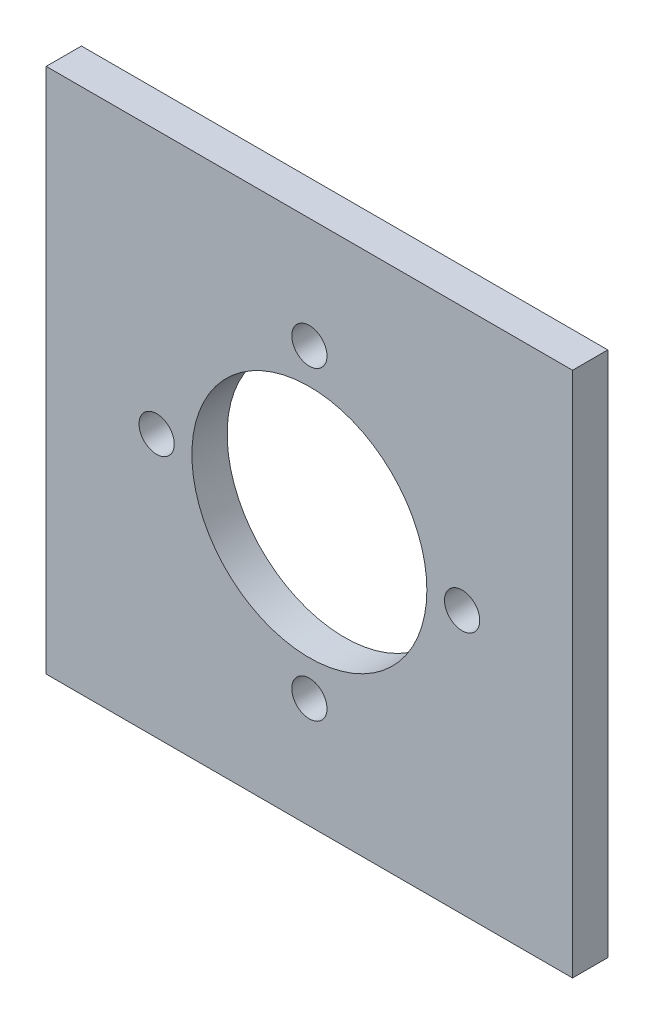
ISO-10303-21;
HEADER;
FILE_DESCRIPTION(('STEP AP214'),'2;1');
FILE_NAME('part.step','',(''),(''),'','','');
FILE_SCHEMA(('AUTOMOTIVE_DESIGN { 1 0 10303 214 1 1 1 1 }'));
ENDSEC;
DATA;
#1=APPLICATION_CONTEXT('core data for automotive mechanical design processes');
#2=APPLICATION_PROTOCOL_DEFINITION('international standard','automotive_design',2000,#1);
#3=PRODUCT_CONTEXT('',#1,'mechanical');
#4=PRODUCT('Part','Part','',(#3));
#5=PRODUCT_RELATED_PRODUCT_CATEGORY('part','',(#4));
#6=PRODUCT_DEFINITION_FORMATION('','',#4);
#7=PRODUCT_DEFINITION_CONTEXT('part definition',#1,'design');
#8=PRODUCT_DEFINITION('design','',#6,#7);
#9=PRODUCT_DEFINITION_SHAPE('','',#8);
#10=(LENGTH_UNIT() NAMED_UNIT(*) SI_UNIT(.MILLI.,.METRE.));
#11=(NAMED_UNIT(*) PLANE_ANGLE_UNIT() SI_UNIT($,.RADIAN.));
#12=(NAMED_UNIT(*) SI_UNIT($,.STERADIAN.) SOLID_ANGLE_UNIT());
#13=UNCERTAINTY_MEASURE_WITH_UNIT(LENGTH_MEASURE(1.E-05),#10,'distance_accuracy_value','');
#14=(GEOMETRIC_REPRESENTATION_CONTEXT(3) GLOBAL_UNCERTAINTY_ASSIGNED_CONTEXT((#13)) GLOBAL_UNIT_ASSIGNED_CONTEXT((#10,
#11,#12)) REPRESENTATION_CONTEXT('',''));
#15=CARTESIAN_POINT('',(0.,0.,0.));
#16=DIRECTION('',(0.,0.,1.));
#17=DIRECTION('',(1.,0.,0.));
#18=AXIS2_PLACEMENT_3D('',#15,#16,#17);
#19=CARTESIAN_POINT('',(-35.6819043920558,22.1052836484983,3.));
#20=DIRECTION('',(1.,0.,0.));
#21=DIRECTION('',(0.,0.,-1.));
#22=AXIS2_PLACEMENT_3D('',#19,#20,#21);
#23=PLANE('',#22);
#24=DIRECTION('',(0.,-1.,0.));
#25=VECTOR('',#24,1.);
#26=CARTESIAN_POINT('',(-35.6819043920558,22.1052836484983,0.));
#27=LINE('',#26,#25);
#28=CARTESIAN_POINT('',(-35.6819043920558,22.1052836484983,0.));
#29=VERTEX_POINT('',#28);
#30=CARTESIAN_POINT('',(-35.6819043920558,-22.6947163515017,0.));
#31=VERTEX_POINT('',#30);
#32=EDGE_CURVE('E96',#29,#31,#27,.T.);
#33=ORIENTED_EDGE('',*,*,#32,.T.);
#34=DIRECTION('',(0.,0.,-1.));
#35=VECTOR('',#34,1.);
#36=CARTESIAN_POINT('',(-35.6819043920558,-22.6947163515017,3.));
#37=LINE('',#36,#35);
#38=CARTESIAN_POINT('',(-35.6819043920558,-22.6947163515017,3.));
#39=VERTEX_POINT('',#38);
#40=EDGE_CURVE('E11',#39,#31,#37,.T.);
#41=ORIENTED_EDGE('',*,*,#40,.F.);
#42=DIRECTION('',(0.,-1.,0.));
#43=VECTOR('',#42,1.);
#44=CARTESIAN_POINT('',(-35.6819043920558,22.1052836484983,3.));
#45=LINE('',#44,#43);
#46=CARTESIAN_POINT('',(-35.6819043920558,22.1052836484983,3.));
#47=VERTEX_POINT('',#46);
#48=EDGE_CURVE('E84',#47,#39,#45,.T.);
#49=ORIENTED_EDGE('',*,*,#48,.F.);
#50=DIRECTION('',(0.,0.,-1.));
#51=VECTOR('',#50,1.);
#52=CARTESIAN_POINT('',(-35.6819043920558,22.1052836484983,3.));
#53=LINE('',#52,#51);
#54=EDGE_CURVE('E92',#47,#29,#53,.T.);
#55=ORIENTED_EDGE('',*,*,#54,.T.);
#56=EDGE_LOOP('',(#33,#41,#49,#55));
#57=FACE_BOUND('',#56,.T.);
#58=ADVANCED_FACE('F33',(#57),#23,.F.);
#59=CARTESIAN_POINT('',(-35.6819043920558,-22.6947163515017,3.));
#60=DIRECTION('',(0.,1.,0.));
#61=DIRECTION('',(0.,0.,1.));
#62=AXIS2_PLACEMENT_3D('',#59,#60,#61);
#63=PLANE('',#62);
#64=DIRECTION('',(1.,0.,0.));
#65=VECTOR('',#64,1.);
#66=CARTESIAN_POINT('',(-35.6819043920558,-22.6947163515017,0.));
#67=LINE('',#66,#65);
#68=CARTESIAN_POINT('',(9.11809560794424,-22.6947163515017,0.));
#69=VERTEX_POINT('',#68);
#70=EDGE_CURVE('E88',#31,#69,#67,.T.);
#71=ORIENTED_EDGE('',*,*,#70,.T.);
#72=DIRECTION('',(0.,0.,-1.));
#73=VECTOR('',#72,1.);
#74=CARTESIAN_POINT('',(9.11809560794424,-22.6947163515017,3.));
#75=LINE('',#74,#73);
#76=CARTESIAN_POINT('',(9.11809560794424,-22.6947163515017,3.));
#77=VERTEX_POINT('',#76);
#78=EDGE_CURVE('E41',#77,#69,#75,.T.);
#79=ORIENTED_EDGE('',*,*,#78,.F.);
#80=DIRECTION('',(1.,0.,0.));
#81=VECTOR('',#80,1.);
#82=CARTESIAN_POINT('',(-35.6819043920558,-22.6947163515017,3.));
#83=LINE('',#82,#81);
#84=EDGE_CURVE('E79',#39,#77,#83,.T.);
#85=ORIENTED_EDGE('',*,*,#84,.F.);
#86=ORIENTED_EDGE('',*,*,#40,.T.);
#87=EDGE_LOOP('',(#71,#79,#85,#86));
#88=FACE_BOUND('',#87,.T.);
#89=ADVANCED_FACE('F87',(#88),#63,.F.);
#90=CARTESIAN_POINT('',(9.11809560794424,22.1052836484983,3.));
#91=DIRECTION('',(-1.,0.,0.));
#92=DIRECTION('',(0.,-1.,0.));
#93=AXIS2_PLACEMENT_3D('',#90,#91,#92);
#94=PLANE('',#93);
#95=DIRECTION('',(0.,1.,0.));
#96=VECTOR('',#95,1.);
#97=CARTESIAN_POINT('',(9.11809560794424,22.1052836484983,0.));
#98=LINE('',#97,#96);
#99=CARTESIAN_POINT('',(9.11809560794424,22.1052836484983,0.));
#100=VERTEX_POINT('',#99);
#101=EDGE_CURVE('E66',#69,#100,#98,.T.);
#102=ORIENTED_EDGE('',*,*,#101,.T.);
#103=DIRECTION('',(0.,0.,-1.));
#104=VECTOR('',#103,1.);
#105=CARTESIAN_POINT('',(9.11809560794424,22.1052836484983,3.));
#106=LINE('',#105,#104);
#107=CARTESIAN_POINT('',(9.11809560794424,22.1052836484983,3.));
#108=VERTEX_POINT('',#107);
#109=EDGE_CURVE('E89',#108,#100,#106,.T.);
#110=ORIENTED_EDGE('',*,*,#109,.F.);
#111=DIRECTION('',(0.,1.,0.));
#112=VECTOR('',#111,1.);
#113=CARTESIAN_POINT('',(9.11809560794424,22.1052836484983,3.));
#114=LINE('',#113,#112);
#115=EDGE_CURVE('E82',#77,#108,#114,.T.);
#116=ORIENTED_EDGE('',*,*,#115,.F.);
#117=ORIENTED_EDGE('',*,*,#78,.T.);
#118=EDGE_LOOP('',(#102,#110,#116,#117));
#119=FACE_BOUND('',#118,.T.);
#120=ADVANCED_FACE('F90',(#119),#94,.F.);
#121=CARTESIAN_POINT('',(-35.6819043920558,22.1052836484983,3.));
#122=DIRECTION('',(0.,-1.,0.));
#123=DIRECTION('',(0.,0.,-1.));
#124=AXIS2_PLACEMENT_3D('',#121,#122,#123);
#125=PLANE('',#124);
#126=DIRECTION('',(-1.,0.,0.));
#127=VECTOR('',#126,1.);
#128=CARTESIAN_POINT('',(-35.6819043920558,22.1052836484983,0.));
#129=LINE('',#128,#127);
#130=EDGE_CURVE('E72',#100,#29,#129,.T.);
#131=ORIENTED_EDGE('',*,*,#130,.T.);
#132=ORIENTED_EDGE('',*,*,#54,.F.);
#133=DIRECTION('',(-1.,0.,0.));
#134=VECTOR('',#133,1.);
#135=CARTESIAN_POINT('',(-35.6819043920558,22.1052836484983,3.));
#136=LINE('',#135,#134);
#137=EDGE_CURVE('E49',#108,#47,#136,.T.);
#138=ORIENTED_EDGE('',*,*,#137,.F.);
#139=ORIENTED_EDGE('',*,*,#109,.T.);
#140=EDGE_LOOP('',(#131,#132,#138,#139));
#141=FACE_BOUND('',#140,.T.);
#142=ADVANCED_FACE('F104',(#141),#125,.F.);
#143=CARTESIAN_POINT('',(-35.6819043920558,-22.6947163515017,3.));
#144=DIRECTION('',(0.,0.,1.));
#145=DIRECTION('',(1.,0.,0.));
#146=AXIS2_PLACEMENT_3D('',#143,#144,#145);
#147=PLANE('',#146);
#148=CARTESIAN_POINT('',(-26.2819043920556,-0.294716351501705,3.));
#149=DIRECTION('',(0.,0.,1.));
#150=DIRECTION('',(1.,0.,0.));
#151=AXIS2_PLACEMENT_3D('',#148,#149,#150);
#152=CIRCLE('',#151,1.5);
#153=CARTESIAN_POINT('',(-24.7819043920556,-0.294716351501705,3.));
#154=VERTEX_POINT('',#153);
#155=EDGE_CURVE('E134',#154,#154,#152,.T.);
#156=ORIENTED_EDGE('',*,*,#155,.F.);
#157=EDGE_LOOP('',(#156));
#158=FACE_BOUND('',#157,.T.);
#159=CARTESIAN_POINT('',(-13.2819043920555,-13.2947163515017,3.));
#160=DIRECTION('',(0.,0.,1.));
#161=DIRECTION('',(1.,0.,0.));
#162=AXIS2_PLACEMENT_3D('',#159,#160,#161);
#163=CIRCLE('',#162,1.5);
#164=CARTESIAN_POINT('',(-11.7819043920555,-13.2947163515017,3.));
#165=VERTEX_POINT('',#164);
#166=EDGE_CURVE('E128',#165,#165,#163,.T.);
#167=ORIENTED_EDGE('',*,*,#166,.F.);
#168=EDGE_LOOP('',(#167));
#169=FACE_BOUND('',#168,.T.);
#170=CARTESIAN_POINT('',(-0.281904392055582,-0.294716351501528,3.));
#171=DIRECTION('',(0.,0.,1.));
#172=DIRECTION('',(1.,0.,0.));
#173=AXIS2_PLACEMENT_3D('',#170,#171,#172);
#174=CIRCLE('',#173,1.5);
#175=CARTESIAN_POINT('',(1.21809560794442,-0.294716351501528,3.));
#176=VERTEX_POINT('',#175);
#177=EDGE_CURVE('E122',#176,#176,#174,.T.);
#178=ORIENTED_EDGE('',*,*,#177,.F.);
#179=EDGE_LOOP('',(#178));
#180=FACE_BOUND('',#179,.T.);
#181=CARTESIAN_POINT('',(-13.2819043920558,-0.294716351501662,3.));
#182=DIRECTION('',(0.,0.,1.));
#183=DIRECTION('',(1.,0.,0.));
#184=AXIS2_PLACEMENT_3D('',#181,#182,#183);
#185=CIRCLE('',#184,10.);
#186=CARTESIAN_POINT('',(-3.28190439205576,-0.294716351501662,3.));
#187=VERTEX_POINT('',#186);
#188=EDGE_CURVE('E116',#187,#187,#185,.T.);
#189=ORIENTED_EDGE('',*,*,#188,.F.);
#190=EDGE_LOOP('',(#189));
#191=FACE_BOUND('',#190,.T.);
#192=CARTESIAN_POINT('',(-13.2819043920558,12.7052836484983,3.));
#193=DIRECTION('',(0.,0.,1.));
#194=DIRECTION('',(1.,0.,0.));
#195=AXIS2_PLACEMENT_3D('',#192,#193,#194);
#196=CIRCLE('',#195,1.5);
#197=CARTESIAN_POINT('',(-11.7819043920558,12.7052836484983,3.));
#198=VERTEX_POINT('',#197);
#199=EDGE_CURVE('E110',#198,#198,#196,.T.);
#200=ORIENTED_EDGE('',*,*,#199,.F.);
#201=EDGE_LOOP('',(#200));
#202=FACE_BOUND('',#201,.T.);
#203=ORIENTED_EDGE('',*,*,#48,.T.);
#204=ORIENTED_EDGE('',*,*,#84,.T.);
#205=ORIENTED_EDGE('',*,*,#115,.T.);
#206=ORIENTED_EDGE('',*,*,#137,.T.);
#207=EDGE_LOOP('',(#203,#204,#205,#206));
#208=FACE_BOUND('',#207,.T.);
#209=ADVANCED_FACE('F80',(#158,#169,#180,#191,#202,#208),#147,.T.);
#210=CARTESIAN_POINT('',(-35.6819043920558,-22.6947163515017,0.));
#211=DIRECTION('',(0.,0.,1.));
#212=DIRECTION('',(1.,0.,0.));
#213=AXIS2_PLACEMENT_3D('',#210,#211,#212);
#214=PLANE('',#213);
#215=CARTESIAN_POINT('',(-26.2819043920556,-0.294716351501705,0.));
#216=DIRECTION('',(0.,0.,1.));
#217=DIRECTION('',(1.,0.,0.));
#218=AXIS2_PLACEMENT_3D('',#215,#216,#217);
#219=CIRCLE('',#218,1.5);
#220=CARTESIAN_POINT('',(-24.7819043920556,-0.294716351501705,0.));
#221=VERTEX_POINT('',#220);
#222=EDGE_CURVE('E131',#221,#221,#219,.T.);
#223=ORIENTED_EDGE('',*,*,#222,.T.);
#224=EDGE_LOOP('',(#223));
#225=FACE_BOUND('',#224,.T.);
#226=CARTESIAN_POINT('',(-13.2819043920555,-13.2947163515017,0.));
#227=DIRECTION('',(0.,0.,1.));
#228=DIRECTION('',(1.,0.,0.));
#229=AXIS2_PLACEMENT_3D('',#226,#227,#228);
#230=CIRCLE('',#229,1.5);
#231=CARTESIAN_POINT('',(-11.7819043920555,-13.2947163515017,0.));
#232=VERTEX_POINT('',#231);
#233=EDGE_CURVE('E125',#232,#232,#230,.T.);
#234=ORIENTED_EDGE('',*,*,#233,.T.);
#235=EDGE_LOOP('',(#234));
#236=FACE_BOUND('',#235,.T.);
#237=CARTESIAN_POINT('',(-0.281904392055582,-0.294716351501528,0.));
#238=DIRECTION('',(0.,0.,1.));
#239=DIRECTION('',(1.,0.,0.));
#240=AXIS2_PLACEMENT_3D('',#237,#238,#239);
#241=CIRCLE('',#240,1.5);
#242=CARTESIAN_POINT('',(1.21809560794442,-0.294716351501528,0.));
#243=VERTEX_POINT('',#242);
#244=EDGE_CURVE('E119',#243,#243,#241,.T.);
#245=ORIENTED_EDGE('',*,*,#244,.T.);
#246=EDGE_LOOP('',(#245));
#247=FACE_BOUND('',#246,.T.);
#248=CARTESIAN_POINT('',(-13.2819043920558,-0.294716351501662,0.));
#249=DIRECTION('',(0.,0.,1.));
#250=DIRECTION('',(1.,0.,0.));
#251=AXIS2_PLACEMENT_3D('',#248,#249,#250);
#252=CIRCLE('',#251,10.);
#253=CARTESIAN_POINT('',(-3.28190439205576,-0.294716351501662,0.));
#254=VERTEX_POINT('',#253);
#255=EDGE_CURVE('E113',#254,#254,#252,.T.);
#256=ORIENTED_EDGE('',*,*,#255,.T.);
#257=EDGE_LOOP('',(#256));
#258=FACE_BOUND('',#257,.T.);
#259=CARTESIAN_POINT('',(-13.2819043920558,12.7052836484983,0.));
#260=DIRECTION('',(0.,0.,1.));
#261=DIRECTION('',(1.,0.,0.));
#262=AXIS2_PLACEMENT_3D('',#259,#260,#261);
#263=CIRCLE('',#262,1.5);
#264=CARTESIAN_POINT('',(-11.7819043920558,12.7052836484983,0.));
#265=VERTEX_POINT('',#264);
#266=EDGE_CURVE('E99',#265,#265,#263,.T.);
#267=ORIENTED_EDGE('',*,*,#266,.T.);
#268=EDGE_LOOP('',(#267));
#269=FACE_BOUND('',#268,.T.);
#270=ORIENTED_EDGE('',*,*,#32,.F.);
#271=ORIENTED_EDGE('',*,*,#130,.F.);
#272=ORIENTED_EDGE('',*,*,#101,.F.);
#273=ORIENTED_EDGE('',*,*,#70,.F.);
#274=EDGE_LOOP('',(#270,#271,#272,#273));
#275=FACE_BOUND('',#274,.T.);
#276=ADVANCED_FACE('F107',(#225,#236,#247,#258,#269,#275),#214,.F.);
#277=CARTESIAN_POINT('',(-13.2819043920558,12.7052836484983,0.));
#278=DIRECTION('',(0.,0.,1.));
#279=DIRECTION('',(1.,0.,0.));
#280=AXIS2_PLACEMENT_3D('',#277,#278,#279);
#281=CYLINDRICAL_SURFACE('',#280,1.5);
#282=ORIENTED_EDGE('',*,*,#266,.F.);
#283=EDGE_LOOP('',(#282));
#284=FACE_BOUND('',#283,.T.);
#285=ORIENTED_EDGE('',*,*,#199,.T.);
#286=EDGE_LOOP('',(#285));
#287=FACE_BOUND('',#286,.T.);
#288=ADVANCED_FACE('F160',(#284,#287),#281,.F.);
#289=CARTESIAN_POINT('',(-13.2819043920558,-0.294716351501662,0.));
#290=DIRECTION('',(0.,0.,1.));
#291=DIRECTION('',(1.,0.,0.));
#292=AXIS2_PLACEMENT_3D('',#289,#290,#291);
#293=CYLINDRICAL_SURFACE('',#292,10.);
#294=ORIENTED_EDGE('',*,*,#255,.F.);
#295=EDGE_LOOP('',(#294));
#296=FACE_BOUND('',#295,.T.);
#297=ORIENTED_EDGE('',*,*,#188,.T.);
#298=EDGE_LOOP('',(#297));
#299=FACE_BOUND('',#298,.T.);
#300=ADVANCED_FACE('F162',(#296,#299),#293,.F.);
#301=CARTESIAN_POINT('',(-0.281904392055582,-0.294716351501528,0.));
#302=DIRECTION('',(0.,0.,1.));
#303=DIRECTION('',(1.,0.,0.));
#304=AXIS2_PLACEMENT_3D('',#301,#302,#303);
#305=CYLINDRICAL_SURFACE('',#304,1.5);
#306=ORIENTED_EDGE('',*,*,#244,.F.);
#307=EDGE_LOOP('',(#306));
#308=FACE_BOUND('',#307,.T.);
#309=ORIENTED_EDGE('',*,*,#177,.T.);
#310=EDGE_LOOP('',(#309));
#311=FACE_BOUND('',#310,.T.);
#312=ADVANCED_FACE('F169',(#308,#311),#305,.F.);
#313=CARTESIAN_POINT('',(-13.2819043920555,-13.2947163515017,0.));
#314=DIRECTION('',(0.,0.,1.));
#315=DIRECTION('',(1.,0.,0.));
#316=AXIS2_PLACEMENT_3D('',#313,#314,#315);
#317=CYLINDRICAL_SURFACE('',#316,1.5);
#318=ORIENTED_EDGE('',*,*,#233,.F.);
#319=EDGE_LOOP('',(#318));
#320=FACE_BOUND('',#319,.T.);
#321=ORIENTED_EDGE('',*,*,#166,.T.);
#322=EDGE_LOOP('',(#321));
#323=FACE_BOUND('',#322,.T.);
#324=ADVANCED_FACE('F145',(#320,#323),#317,.F.);
#325=CARTESIAN_POINT('',(-26.2819043920556,-0.294716351501705,0.));
#326=DIRECTION('',(0.,0.,1.));
#327=DIRECTION('',(1.,0.,0.));
#328=AXIS2_PLACEMENT_3D('',#325,#326,#327);
#329=CYLINDRICAL_SURFACE('',#328,1.5);
#330=ORIENTED_EDGE('',*,*,#222,.F.);
#331=EDGE_LOOP('',(#330));
#332=FACE_BOUND('',#331,.T.);
#333=ORIENTED_EDGE('',*,*,#155,.T.);
#334=EDGE_LOOP('',(#333));
#335=FACE_BOUND('',#334,.T.);
#336=ADVANCED_FACE('F142',(#332,#335),#329,.F.);
#337=CLOSED_SHELL('',(#58,#89,#120,#142,#209,#276,#288,#300,#312,#324,#336));
#338=MANIFOLD_SOLID_BREP('B2',#337);
#339=ADVANCED_BREP_SHAPE_REPRESENTATION('',(#18,#338),#14);
#340=SHAPE_DEFINITION_REPRESENTATION(#9,#339);
ENDSEC;
END-ISO-10303-21;
